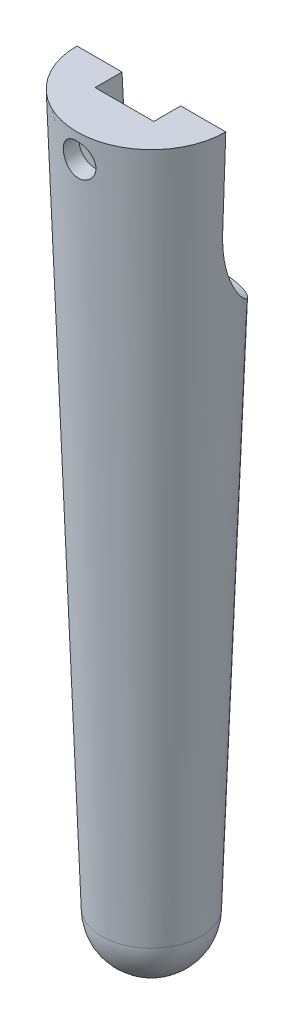
ISO-10303-21;
HEADER;
FILE_DESCRIPTION(('STEP AP214'),'2;1');
FILE_NAME('part.step','',(''),(''),'','','');
FILE_SCHEMA(('AUTOMOTIVE_DESIGN { 1 0 10303 214 1 1 1 1 }'));
ENDSEC;
DATA;
#1=APPLICATION_CONTEXT('core data for automotive mechanical design processes');
#2=APPLICATION_PROTOCOL_DEFINITION('international standard','automotive_design',2000,#1);
#3=PRODUCT_CONTEXT('',#1,'mechanical');
#4=PRODUCT('Part','Part','',(#3));
#5=PRODUCT_RELATED_PRODUCT_CATEGORY('part','',(#4));
#6=PRODUCT_DEFINITION_FORMATION('','',#4);
#7=PRODUCT_DEFINITION_CONTEXT('part definition',#1,'design');
#8=PRODUCT_DEFINITION('design','',#6,#7);
#9=PRODUCT_DEFINITION_SHAPE('','',#8);
#10=(LENGTH_UNIT() NAMED_UNIT(*) SI_UNIT(.MILLI.,.METRE.));
#11=(NAMED_UNIT(*) PLANE_ANGLE_UNIT() SI_UNIT($,.RADIAN.));
#12=(NAMED_UNIT(*) SI_UNIT($,.STERADIAN.) SOLID_ANGLE_UNIT());
#13=UNCERTAINTY_MEASURE_WITH_UNIT(LENGTH_MEASURE(1.E-05),#10,'distance_accuracy_value','');
#14=(GEOMETRIC_REPRESENTATION_CONTEXT(3) GLOBAL_UNCERTAINTY_ASSIGNED_CONTEXT((#13)) GLOBAL_UNIT_ASSIGNED_CONTEXT((#10,
#11,#12)) REPRESENTATION_CONTEXT('',''));
#15=CARTESIAN_POINT('',(0.,0.,0.));
#16=DIRECTION('',(0.,0.,1.));
#17=DIRECTION('',(1.,0.,0.));
#18=AXIS2_PLACEMENT_3D('',#15,#16,#17);
#19=CARTESIAN_POINT('',(1.26287869051112E-11,96.5500000000219,0.));
#20=DIRECTION('',(0.,0.,1.));
#21=DIRECTION('',(1.,0.,0.));
#22=AXIS2_PLACEMENT_3D('',#19,#20,#21);
#23=PLANE('',#22);
#24=DIRECTION('',(0.0348994967025011,0.999390827019096,0.));
#25=VECTOR('',#24,1.);
#26=CARTESIAN_POINT('',(0.,-200.453772980408,0.));
#27=LINE('',#26,#25);
#28=CARTESIAN_POINT('',(10.057110650716,87.5441949078026,0.));
#29=VERTEX_POINT('',#28);
#30=CARTESIAN_POINT('',(10.4920769491748,100.,0.));
#31=VERTEX_POINT('',#30);
#32=EDGE_CURVE('E148',#29,#31,#27,.T.);
#33=ORIENTED_EDGE('',*,*,#32,.F.);
#34=CARTESIAN_POINT('',(1.26287869051112E-11,96.5500000000219,0.));
#35=DIRECTION('',(0.,0.,1.));
#36=DIRECTION('',(1.,0.,0.));
#37=AXIS2_PLACEMENT_3D('',#34,#35,#36);
#38=CIRCLE('',#37,13.4999999999828);
#39=CARTESIAN_POINT('',(2.54703080190939,83.2924499211527,0.));
#40=VERTEX_POINT('',#39);
#41=EDGE_CURVE('E295',#29,#40,#38,.F.);
#42=ORIENTED_EDGE('',*,*,#41,.T.);
#43=DIRECTION('',(0.0545609835210561,0.998510440144326,0.));
#44=VECTOR('',#43,1.);
#45=CARTESIAN_POINT('',(3.14054713278725,94.1542822147181,0.));
#46=LINE('',#45,#44);
#47=CARTESIAN_POINT('',(3.14054713278725,94.1542822147181,0.));
#48=VERTEX_POINT('',#47);
#49=EDGE_CURVE('E245',#40,#48,#46,.T.);
#50=ORIENTED_EDGE('',*,*,#49,.T.);
#51=CARTESIAN_POINT('',(1.26286607405701E-11,96.5500000000219,0.));
#52=DIRECTION('',(0.,0.,1.));
#53=DIRECTION('',(1.,0.,0.));
#54=AXIS2_PLACEMENT_3D('',#51,#52,#53);
#55=CIRCLE('',#54,3.95);
#56=CARTESIAN_POINT('',(3.94997479220084,96.5358882645625,0.));
#57=VERTEX_POINT('',#56);
#58=EDGE_CURVE('E133',#48,#57,#55,.T.);
#59=ORIENTED_EDGE('',*,*,#58,.T.);
#60=DIRECTION('',(-0.0545609835210561,-0.998510440144326,0.));
#61=VECTOR('',#60,1.);
#62=CARTESIAN_POINT('',(3.94997479220084,96.5358882645625,0.));
#63=LINE('',#62,#61);
#64=CARTESIAN_POINT('',(4.13926209027355,100.,0.));
#65=VERTEX_POINT('',#64);
#66=EDGE_CURVE('E127',#65,#57,#63,.T.);
#67=ORIENTED_EDGE('',*,*,#66,.F.);
#68=DIRECTION('',(1.,0.,0.));
#69=VECTOR('',#68,1.);
#70=CARTESIAN_POINT('',(0.,100.,0.));
#71=LINE('',#70,#69);
#72=EDGE_CURVE('E130',#65,#31,#71,.T.);
#73=ORIENTED_EDGE('',*,*,#72,.T.);
#74=EDGE_LOOP('',(#33,#42,#50,#59,#67,#73));
#75=FACE_BOUND('',#74,.T.);
#76=ADVANCED_FACE('F39',(#75),#23,.F.);
#77=CARTESIAN_POINT('',(0.,0.,0.));
#78=DIRECTION('',(0.,1.,0.));
#79=DIRECTION('',(0.,0.,1.));
#80=AXIS2_PLACEMENT_3D('',#77,#78,#79);
#81=CONICAL_SURFACE('',#80,7.,0.0349065850398867);
#82=CARTESIAN_POINT('',(-1.64992104987884,94.9475766698289,10.1828404412526));
#83=CARTESIAN_POINT('',(-1.73919596378949,95.0395027192175,10.1716275625867));
#84=CARTESIAN_POINT('',(-1.82082745845652,95.138958223404,10.160726093328));
#85=CARTESIAN_POINT('',(-1.96650143168217,95.3502679657733,10.141059490115));
#86=CARTESIAN_POINT('',(-2.03053379267208,95.4621292842945,10.13229558535));
#87=CARTESIAN_POINT('',(-2.13913797435218,95.6952340145005,10.1182461436707));
#88=CARTESIAN_POINT('',(-2.18369844168915,95.8164828513397,10.1129626351403));
#89=CARTESIAN_POINT('',(-2.25192475390324,96.0648101008327,10.1068752154501));
#90=CARTESIAN_POINT('',(-2.27559570905781,96.1918870797204,10.1060702084423));
#91=CARTESIAN_POINT('',(-2.30116220108725,96.4462790908929,10.1093902617387));
#92=CARTESIAN_POINT('',(-2.3033689514045,96.5735638703085,10.1134439013857));
#93=CARTESIAN_POINT('',(-2.28683245595834,96.8265211840433,10.1262516477096));
#94=CARTESIAN_POINT('',(-2.26808877985903,96.9521936851915,10.1350058509372));
#95=CARTESIAN_POINT('',(-2.21039811256436,97.1981182822743,10.1565317203145));
#96=CARTESIAN_POINT('',(-2.17149936934436,97.3183825806752,10.1692937637305));
#97=CARTESIAN_POINT('',(-2.07473717396291,97.5506497027634,10.1977513038028));
#98=CARTESIAN_POINT('',(-2.01687112534424,97.6626513927993,10.2134472019513));
#99=CARTESIAN_POINT('',(-1.8822426195446,97.8780289216952,10.2467691387484));
#100=CARTESIAN_POINT('',(-1.80507411404669,97.9811453814807,10.264431419282));
#101=CARTESIAN_POINT('',(-1.63463424979343,98.1730986121634,10.2997352086698));
#102=CARTESIAN_POINT('',(-1.54136092601835,98.2619336379627,10.3173767147244));
#103=CARTESIAN_POINT('',(-1.33948364277009,98.424253584942,10.3512524804897));
#104=CARTESIAN_POINT('',(-1.23065510707794,98.4974654852832,10.3674592005593));
#105=CARTESIAN_POINT('',(-1.00179942525342,98.6244925904066,10.3965241189878));
#106=CARTESIAN_POINT('',(-0.881773501302927,98.6783099089738,10.4093826822147));
#107=CARTESIAN_POINT('',(-0.635887211832571,98.7641214696164,10.4302698351862));
#108=CARTESIAN_POINT('',(-0.51014852707311,98.7964461051787,10.438371313901));
#109=CARTESIAN_POINT('',(-0.254809118315023,98.8395036083754,10.4492254624981));
#110=CARTESIAN_POINT('',(-0.125209125124158,98.8502405357772,10.4519791380806));
#111=CARTESIAN_POINT('',(0.130453633407846,98.849757762061,10.451856549519));
#112=CARTESIAN_POINT('',(0.256517987254769,98.8391195715972,10.449129391165));
#113=CARTESIAN_POINT('',(0.504993891668115,98.7974099013381,10.4386135524253));
#114=CARTESIAN_POINT('',(0.627405478337431,98.7663386235675,10.430824922083));
#115=CARTESIAN_POINT('',(0.865039730109908,98.6848229817193,10.4109541419713));
#116=CARTESIAN_POINT('',(0.980271083593251,98.6344025816638,10.3988773045532));
#117=CARTESIAN_POINT('',(1.20071856444346,98.5156942267308,10.371562827916));
#118=CARTESIAN_POINT('',(1.30593323725316,98.4474036822483,10.3563247306576));
#119=CARTESIAN_POINT('',(1.50627687581789,98.2928551787577,10.3236605160806));
#120=CARTESIAN_POINT('',(1.60107638052199,98.2061798488678,10.3061881619442));
#121=CARTESIAN_POINT('',(1.7749538265541,98.0183073158587,10.2710141728444));
#122=CARTESIAN_POINT('',(1.85402958819198,97.9171081027221,10.2533125064544));
#123=CARTESIAN_POINT('',(1.99568556862242,97.7007677689217,10.2189989764335));
#124=CARTESIAN_POINT('',(2.05792584619123,97.5853993325405,10.2024140268606));
#125=CARTESIAN_POINT('',(2.16203224305112,97.3454348288393,10.1722960145521));
#126=CARTESIAN_POINT('',(2.20390035691554,97.2208396662554,10.1587626531149));
#127=CARTESIAN_POINT('',(2.26546979369175,96.9676149260736,10.1361487843385));
#128=CARTESIAN_POINT('',(2.28545167013979,96.8390586665286,10.1270127819125));
#129=CARTESIAN_POINT('',(2.30345803855993,96.5801711689549,10.1136611887188));
#130=CARTESIAN_POINT('',(2.301486159406,96.4498402278316,10.1094447848872));
#131=CARTESIAN_POINT('',(2.27588739332845,96.1944613434707,10.1060959851112));
#132=CARTESIAN_POINT('',(2.25278632937358,96.069361907877,10.1068428870513));
#133=CARTESIAN_POINT('',(2.18634457443719,95.8247704297894,10.1126841994544));
#134=CARTESIAN_POINT('',(2.14300363585547,95.7052784559128,10.1177786631031));
#135=CARTESIAN_POINT('',(2.0373649751987,95.4752116389152,10.1313822317331));
#136=CARTESIAN_POINT('',(1.97506664119963,95.3646370837845,10.1398914469418));
#137=CARTESIAN_POINT('',(1.83327222730296,95.1553328652881,10.1590557673891));
#138=CARTESIAN_POINT('',(1.75377407729557,95.0566046299297,10.16971113092));
#139=CARTESIAN_POINT('',(1.57798896949655,94.8717457738773,10.1919466758002));
#140=CARTESIAN_POINT('',(1.48140130316517,94.785902634086,10.203540971169));
#141=CARTESIAN_POINT('',(1.27517100439738,94.6315290891314,10.2259265732837));
#142=CARTESIAN_POINT('',(1.16552780674567,94.5629994339249,10.2367178452312));
#143=CARTESIAN_POINT('',(0.935357557569262,94.444778499597,10.256171639512));
#144=CARTESIAN_POINT('',(0.814760246887608,94.3952212721704,10.2648188671107));
#145=CARTESIAN_POINT('',(0.566759395946518,94.3171365959649,10.2787619001937));
#146=CARTESIAN_POINT('',(0.439356697997057,94.2886065510678,10.2840581193984));
#147=CARTESIAN_POINT('',(0.183268524341992,94.253725062482,10.2905665377222));
#148=CARTESIAN_POINT('',(0.0546259919532527,94.2470686507621,10.2918348860173));
#149=CARTESIAN_POINT('',(-0.201956062062696,94.2552913187593,10.2902852759112));
#150=CARTESIAN_POINT('',(-0.329895534379168,94.2701718901498,10.2874670344686));
#151=CARTESIAN_POINT('',(-0.580240427212458,94.3207646026803,10.2781443213567));
#152=CARTESIAN_POINT('',(-0.702684986002133,94.3562900391249,10.271672902514));
#153=CARTESIAN_POINT('',(-0.93982847471391,94.4469496064954,10.2558734227231));
#154=CARTESIAN_POINT('',(-1.05453147016883,94.5020733483922,10.2465468756368));
#155=CARTESIAN_POINT('',(-1.25297742114045,94.6184867090068,10.2280793182706));
#156=CARTESIAN_POINT('',(-1.33853017081327,94.6767674022808,10.2192209274875));
#157=CARTESIAN_POINT('',(-1.50101820774092,94.8042596763618,10.2011210564788));
#158=CARTESIAN_POINT('',(-1.57795319597716,94.8734716362606,10.1918795629756));
#159=CARTESIAN_POINT('',(-1.64992104987884,94.9475766698289,10.1828404412526));
#160=B_SPLINE_CURVE_WITH_KNOTS('',3,(#82,#83,#84,#85,#86,#87,#88,#89,#90,#91,#92,#93,#94,#95,
#96,#97,#98,#99,#100,#101,#102,#103,#104,#105,#106,#107,#108,#109,#110,#111,#112,#113,#114,#115,
#116,#117,#118,#119,#120,#121,#122,#123,#124,#125,#126,#127,#128,#129,#130,#131,#132,#133,#134,
#135,#136,#137,#138,#139,#140,#141,#142,#143,#144,#145,#146,#147,#148,#149,#150,#151,#152,#153,
#154,#155,#156,#157,#158,#159),.UNSPECIFIED.,.T.,.F.,(4,2,2,2,2,2,2,2,2,2,2,2,2,2,2,2,2,2,2,2,2,
2,2,2,2,2,2,2,2,2,2,2,2,2,2,2,2,2,4),(0.,0.385530507759354,0.771282191812696,1.15725849450898,
1.54314034822105,1.92341874130666,2.30370494571061,2.68308498363545,3.06251697705385,
3.45072365445819,3.83897773218296,4.23354357075872,4.62806639320838,5.01637489139934,
5.40461035776657,5.78242686488873,6.16023963654426,6.53758598678084,6.9149870494833,
7.30210595076344,7.68927847870802,8.08376715283829,8.47821719606943,8.86754947552642,
9.25681740076419,9.63665400033275,10.0164952466737,10.3963487551762,10.7762480069784,
11.1636541335475,11.5510770382569,11.9411889071399,12.3312526028431,12.7158543211952,
13.1004826787273,13.4816855642676,13.8626866753496,14.173466486282,14.4842570772966),.UNSPECIFIED.);
#161=CARTESIAN_POINT('',(-1.64992104987884,94.9475766698289,10.1828404412526));
#162=VERTEX_POINT('',#161);
#163=EDGE_CURVE('E167',#162,#162,#160,.T.);
#164=ORIENTED_EDGE('',*,*,#163,.T.);
#165=EDGE_LOOP('',(#164));
#166=FACE_BOUND('',#165,.T.);
#167=CARTESIAN_POINT('',(0.,0.,0.));
#168=DIRECTION('',(0.,-1.,0.));
#169=DIRECTION('',(0.,0.,1.));
#170=AXIS2_PLACEMENT_3D('',#167,#168,#169);
#171=CIRCLE('',#170,7.);
#172=CARTESIAN_POINT('',(0.,0.,7.));
#173=VERTEX_POINT('',#172);
#174=EDGE_CURVE('E277',#173,#173,#171,.T.);
#175=ORIENTED_EDGE('',*,*,#174,.F.);
#176=EDGE_LOOP('',(#175));
#177=FACE_BOUND('',#176,.T.);
#178=DIRECTION('',(0.0348994967025011,-0.999390827019096,0.));
#179=VECTOR('',#178,1.);
#180=CARTESIAN_POINT('',(0.,-200.453772980408,0.));
#181=LINE('',#180,#179);
#182=CARTESIAN_POINT('',(-10.4920769491748,100.,0.));
#183=VERTEX_POINT('',#182);
#184=CARTESIAN_POINT('',(-10.0571106507171,87.544194907832,0.));
#185=VERTEX_POINT('',#184);
#186=EDGE_CURVE('E253',#183,#185,#181,.T.);
#187=ORIENTED_EDGE('',*,*,#186,.T.);
#188=CARTESIAN_POINT('',(-10.0571106507171,87.544194907832,0.));
#189=CARTESIAN_POINT('',(-10.0479617856498,87.2827104145667,2.14360202404483E-05));
#190=CARTESIAN_POINT('',(-10.0388446627048,87.0211751517433,-0.0042145009018167));
#191=CARTESIAN_POINT('',(-10.0205720071195,86.4983213888195,-0.0224134494180009));
#192=CARTESIAN_POINT('',(-10.0114164575847,86.2370030619779,-0.0363813131896706));
#193=CARTESIAN_POINT('',(-9.99294020418656,85.7142073105471,-0.0753301014465357));
#194=CARTESIAN_POINT('',(-9.98361901811822,85.4527328110487,-0.100351189358853));
#195=CARTESIAN_POINT('',(-9.96459010641846,84.9312609090704,-0.162452002840951));
#196=CARTESIAN_POINT('',(-9.95488244129054,84.6712632826108,-0.199529847382317));
#197=CARTESIAN_POINT('',(-9.93465121151914,84.1530679471528,-0.286678605538028));
#198=CARTESIAN_POINT('',(-9.92412644266742,83.8948735302454,-0.336768961371699));
#199=CARTESIAN_POINT('',(-9.90166827634558,83.3815682809044,-0.450564111292405));
#200=CARTESIAN_POINT('',(-9.88973496861837,83.1264572531578,-0.51426803822075));
#201=CARTESIAN_POINT('',(-9.8636712060295,82.6206588837594,-0.655584445849802));
#202=CARTESIAN_POINT('',(-9.84954431900583,82.3699650820538,-0.733174371816361));
#203=CARTESIAN_POINT('',(-9.81807444882089,81.8736283043539,-0.902439327140019));
#204=CARTESIAN_POINT('',(-9.80073196035225,81.6279845579006,-0.994112189587032));
#205=CARTESIAN_POINT('',(-9.75596160860868,81.0722183302353,-1.2200732846152));
#206=CARTESIAN_POINT('',(-9.72706748257865,80.7640835775062,-1.35900650062587));
#207=CARTESIAN_POINT('',(-9.65899805399721,80.1599510950382,-1.6590754632064));
#208=CARTESIAN_POINT('',(-9.61982167772489,79.8639546365715,-1.82021352767575));
#209=CARTESIAN_POINT('',(-9.52807431793416,79.2869636430863,-2.1623276415011));
#210=CARTESIAN_POINT('',(-9.47554218709323,79.0059284052246,-2.343245295221));
#211=CARTESIAN_POINT('',(-9.3537075747175,78.4598006917572,-2.72267096548586));
#212=CARTESIAN_POINT('',(-9.28440572970214,78.1947076115199,-2.92117831420657));
#213=CARTESIAN_POINT('',(-9.12515692360887,77.6800314173945,-3.33410679972345));
#214=CARTESIAN_POINT('',(-9.03504806280337,77.4305905374542,-3.54864330732498));
#215=CARTESIAN_POINT('',(-8.8314963037939,76.9510348222802,-3.98808855086921));
#216=CARTESIAN_POINT('',(-8.71805242667813,76.7209207983852,-4.21299772164146));
#217=CARTESIAN_POINT('',(-8.46537250819309,76.2812524246772,-4.6684302245241));
#218=CARTESIAN_POINT('',(-8.32613586435693,76.0716985552827,-4.89895368766376));
#219=CARTESIAN_POINT('',(-8.02017174955543,75.674113838139,-5.36032196740838));
#220=CARTESIAN_POINT('',(-7.85344950404131,75.4860789107855,-5.59116671467634));
#221=CARTESIAN_POINT('',(-7.51473799766058,75.1545775233758,-6.01859442664462));
#222=CARTESIAN_POINT('',(-7.34610619285782,75.0084836486078,-6.21580560792948));
#223=CARTESIAN_POINT('',(-6.98743503630847,74.7332352024146,-6.60245209866563));
#224=CARTESIAN_POINT('',(-6.79739719888507,74.6040794341372,-6.79188795687326));
#225=CARTESIAN_POINT('',(-6.39674571252604,74.3626560560178,-7.15919319861802));
#226=CARTESIAN_POINT('',(-6.18614239210329,74.2503800399562,-7.3370683142519));
#227=CARTESIAN_POINT('',(-5.74559594141981,74.0422974549951,-7.67786652109068));
#228=CARTESIAN_POINT('',(-5.51565495029745,73.9464890680017,-7.84079126195151));
#229=CARTESIAN_POINT('',(-5.06825286174055,73.7818268565324,-8.12921981283683));
#230=CARTESIAN_POINT('',(-4.8528478501432,73.711099196556,-8.25685379169989));
#231=CARTESIAN_POINT('',(-4.41012837015727,73.5813586200401,-8.49645601526702));
#232=CARTESIAN_POINT('',(-4.18281463557907,73.5223449827581,-8.60842522367057));
#233=CARTESIAN_POINT('',(-3.71805433933199,73.4155634250683,-8.81507908546756));
#234=CARTESIAN_POINT('',(-3.48061242834264,73.3677904074551,-8.90977156882521));
#235=CARTESIAN_POINT('',(-2.99730989987136,73.2829640179754,-9.08064739898107));
#236=CARTESIAN_POINT('',(-2.75144983443193,73.2459099446861,-9.15683195684264));
#237=CARTESIAN_POINT('',(-2.28368375491903,73.1859762706578,-9.28157467449171));
#238=CARTESIAN_POINT('',(-2.0625213163052,73.1619179609683,-9.33237097161193));
#239=CARTESIAN_POINT('',(-1.61642889069363,73.1214583778837,-9.41845639247972));
#240=CARTESIAN_POINT('',(-1.39149773857562,73.1050595194499,-9.45374062519656));
#241=CARTESIAN_POINT('',(-0.939300402687875,73.0797483144126,-9.50843351810301));
#242=CARTESIAN_POINT('',(-0.712034252310052,73.0708358608992,-9.5278424050008));
#243=CARTESIAN_POINT('',(-0.25661262951372,73.0603944449669,-9.55059845524413));
#244=CARTESIAN_POINT('',(-0.0284574880701886,73.0588629567073,-9.55395111319033));
#245=CARTESIAN_POINT('',(0.447797061515262,73.0633497686636,-9.54415657215643));
#246=CARTESIAN_POINT('',(0.695860846520801,73.0700534328997,-9.52951148401246));
#247=CARTESIAN_POINT('',(1.18975302188162,73.0922834982841,-9.48130506649337));
#248=CARTESIAN_POINT('',(1.4355812915585,73.1078103728913,-9.4477427220075));
#249=CARTESIAN_POINT('',(1.92329100392881,73.1479004491957,-9.36207540962399));
#250=CARTESIAN_POINT('',(2.16517163726655,73.172465480208,-9.30996668802571));
#251=CARTESIAN_POINT('',(2.64320298094326,73.2309385457203,-9.1878152362142));
#252=CARTESIAN_POINT('',(2.87935378259335,73.2648464312253,-9.11777279200022));
#253=CARTESIAN_POINT('',(3.34421861805832,73.3423811672825,-8.96060305500538));
#254=CARTESIAN_POINT('',(3.57293374394649,73.3860065831696,-8.87347828443178));
#255=CARTESIAN_POINT('',(4.02136302273483,73.4834037793925,-8.68321193748473));
#256=CARTESIAN_POINT('',(4.24107718313181,73.5371755512773,-8.58007037445182));
#257=CARTESIAN_POINT('',(4.66997243737138,73.6552877877384,-8.35910406154989));
#258=CARTESIAN_POINT('',(4.87915555080543,73.7196262157292,-8.24128214218252));
#259=CARTESIAN_POINT('',(5.28569198003548,73.8592866304948,-7.99248167500682));
#260=CARTESIAN_POINT('',(5.4830452959759,73.9346086171354,-7.86150312735912));
#261=CARTESIAN_POINT('',(5.86538661369396,74.0968474538151,-7.58770171460822));
#262=CARTESIAN_POINT('',(6.0503326578612,74.1838009357825,-7.44484199216639));
#263=CARTESIAN_POINT('',(6.40622729038958,74.3693806213015,-7.14960141582521));
#264=CARTESIAN_POINT('',(6.57717592925981,74.4680067827296,-6.99722059628585));
#265=CARTESIAN_POINT('',(6.90441505709306,74.6770937569714,-6.68503145226276));
#266=CARTESIAN_POINT('',(7.06070543118996,74.7875546625108,-6.5252230695893));
#267=CARTESIAN_POINT('',(7.35825708679709,75.0203544067507,-6.20036347182684));
#268=CARTESIAN_POINT('',(7.49951798463665,75.142693548525,-6.03531212303562));
#269=CARTESIAN_POINT('',(7.77230115122743,75.4043187143365,-5.69550369928737));
#270=CARTESIAN_POINT('',(7.90320577221209,75.5440875789489,-5.52062282554528));
#271=CARTESIAN_POINT('',(8.14893387967135,75.8361727820563,-5.17006310805664));
#272=CARTESIAN_POINT('',(8.26375702157296,75.9884893892971,-4.99438424729512));
#273=CARTESIAN_POINT('',(8.47794637799129,76.3053878140952,-4.64454553440879));
#274=CARTESIAN_POINT('',(8.57730658848282,76.4699743593814,-4.4703862969836));
#275=CARTESIAN_POINT('',(8.76138840726206,76.8109090914127,-4.12589933601279));
#276=CARTESIAN_POINT('',(8.84610934858683,76.9872578135336,-3.95557178734569));
#277=CARTESIAN_POINT('',(9.01021272368522,77.3703069286809,-3.60321702709383));
#278=CARTESIAN_POINT('',(9.08809794225478,77.5782492426758,-3.42184194324775));
#279=CARTESIAN_POINT('',(9.22908398581185,78.0069753370046,-3.06879663604285));
#280=CARTESIAN_POINT('',(9.29218389480513,78.2277599118979,-2.89712701446613));
#281=CARTESIAN_POINT('',(9.40550967579284,78.6811254629709,-2.56569844862165));
#282=CARTESIAN_POINT('',(9.45573953766191,78.9137027564119,-2.4059358239548));
#283=CARTESIAN_POINT('',(9.54536240505633,79.389643772249,-2.10004081094701));
#284=CARTESIAN_POINT('',(9.58475504775326,79.6330078554685,-1.95390887906778));
#285=CARTESIAN_POINT('',(9.65969556060739,80.1647300353033,-1.6569248905733));
#286=CARTESIAN_POINT('',(9.69389698786331,80.4545601543862,-1.50836429056833));
#287=CARTESIAN_POINT('',(9.75362375736374,81.0449499654201,-1.23230148284336));
#288=CARTESIAN_POINT('',(9.77914812733654,81.3455108555965,-1.10480163582114));
#289=CARTESIAN_POINT('',(9.82411670195538,81.9560899335618,-0.871342797696462));
#290=CARTESIAN_POINT('',(9.84354701730215,82.2661279829081,-0.765433203538036));
#291=CARTESIAN_POINT('',(9.87839916903016,82.8930066871145,-0.575560881766749));
#292=CARTESIAN_POINT('',(9.89382141834499,83.2098466375602,-0.491595893291685));
#293=CARTESIAN_POINT('',(9.92278053730949,83.8584805290252,-0.342657715564415));
#294=CARTESIAN_POINT('',(9.93624332975298,84.190432200614,-0.278360853319928));
#295=CARTESIAN_POINT('',(9.96198001818223,84.8578677193654,-0.171002799303154));
#296=CARTESIAN_POINT('',(9.97425349937718,85.1933527539388,-0.127948995109555));
#297=CARTESIAN_POINT('',(9.99832401961588,85.8645657806488,-0.0613039741196875));
#298=CARTESIAN_POINT('',(10.0101231062478,86.2002844506737,-0.037618012012749));
#299=CARTESIAN_POINT('',(10.02776925411,86.7042138075004,-0.0146294706176147));
#300=CARTESIAN_POINT('',(10.0336398832244,86.8721719166428,-0.00905637683525256));
#301=CARTESIAN_POINT('',(10.0453760564093,87.2081513720278,-0.001740930878733));
#302=CARTESIAN_POINT('',(10.0512416010368,87.3761727073568,1.91396651934407E-06));
#303=CARTESIAN_POINT('',(10.0571106507168,87.5441949078026,0.));
#304=B_SPLINE_CURVE_WITH_KNOTS('',3,(#188,#189,#190,#191,#192,#193,#194,#195,#196,#197,#198,
#199,#200,#201,#202,#203,#204,#205,#206,#207,#208,#209,#210,#211,#212,#213,#214,#215,#216,#217,
#218,#219,#220,#221,#222,#223,#224,#225,#226,#227,#228,#229,#230,#231,#232,#233,#234,#235,#236,
#237,#238,#239,#240,#241,#242,#243,#244,#245,#246,#247,#248,#249,#250,#251,#252,#253,#254,#255,
#256,#257,#258,#259,#260,#261,#262,#263,#264,#265,#266,#267,#268,#269,#270,#271,#272,#273,#274,
#275,#276,#277,#278,#279,#280,#281,#282,#283,#284,#285,#286,#287,#288,#289,#290,#291,#292,#293,
#294,#295,#296,#297,#298,#299,#300,#301,#302,#303),.UNSPECIFIED.,.F.,.F.,(4,2,2,2,2,2,2,2,2,2,2,
2,2,2,2,2,2,2,2,2,2,2,2,2,2,2,2,2,2,2,2,2,2,2,2,2,2,2,2,2,2,2,2,2,2,2,2,2,2,2,2,2,2,2,2,2,2,4),
(0.,0.784972738395995,1.57033713152644,2.3585790342751,3.14669801884185,3.93600138690671,
4.7252544928205,5.51323707818946,6.30109853964748,7.3177215661141,8.33445079540247,
9.34825548259989,10.3620216953667,11.3839589774718,12.4059391389372,13.4279431748038,
14.449753134998,15.3418043466421,16.233792491651,17.1253349390746,18.0167788932298,
18.7963331448343,19.5758394170124,20.3549915277335,21.1340926410113,21.8180011507952,
22.5021251459321,23.1862393712531,23.87011946917,24.614978714319,25.3598779328446,
26.1049280013278,26.8499661888149,27.5948944540642,28.339822098859,29.0846063366753,
29.8293905653984,30.5765781908273,31.3237631199404,32.0709539037066,32.8181637570947,
33.5953360093004,34.3725249111935,35.1500148350254,35.9275401718482,36.7867938240316,
37.6461006954867,38.5051408479236,39.3642097573924,40.345618789747,41.3271377536069,
42.310877763475,43.2945163826796,44.3089276384421,45.3236914220869,46.3334608858727,
46.8378843966005,47.3422430213545),.UNSPECIFIED.);
#305=EDGE_CURVE('E220',#185,#29,#304,.T.);
#306=ORIENTED_EDGE('',*,*,#305,.T.);
#307=ORIENTED_EDGE('',*,*,#32,.T.);
#308=CARTESIAN_POINT('',(0.,100.,0.));
#309=DIRECTION('',(0.,1.,0.));
#310=DIRECTION('',(0.,0.,1.));
#311=AXIS2_PLACEMENT_3D('',#308,#309,#310);
#312=CIRCLE('',#311,10.4920769491748);
#313=EDGE_CURVE('E147',#183,#31,#312,.T.);
#314=ORIENTED_EDGE('',*,*,#313,.F.);
#315=EDGE_LOOP('',(#187,#306,#307,#314));
#316=FACE_BOUND('',#315,.T.);
#317=ADVANCED_FACE('F175',(#166,#177,#316),#81,.T.);
#318=CARTESIAN_POINT('',(0.,100.,0.));
#319=DIRECTION('',(0.,1.,0.));
#320=DIRECTION('',(0.,0.,1.));
#321=AXIS2_PLACEMENT_3D('',#318,#319,#320);
#322=PLANE('',#321);
#323=CARTESIAN_POINT('',(-4.13926209027355,100.,0.));
#324=VERTEX_POINT('',#323);
#325=EDGE_CURVE('E150',#183,#324,#71,.T.);
#326=ORIENTED_EDGE('',*,*,#325,.F.);
#327=ORIENTED_EDGE('',*,*,#313,.T.);
#328=ORIENTED_EDGE('',*,*,#72,.F.);
#329=DIRECTION('',(0.,0.,-1.));
#330=VECTOR('',#329,1.);
#331=CARTESIAN_POINT('',(4.13926209027355,100.,0.));
#332=LINE('',#331,#330);
#333=CARTESIAN_POINT('',(4.13926209027355,100.,3.8));
#334=VERTEX_POINT('',#333);
#335=EDGE_CURVE('E145',#334,#65,#332,.T.);
#336=ORIENTED_EDGE('',*,*,#335,.F.);
#337=DIRECTION('',(1.,0.,0.));
#338=VECTOR('',#337,1.);
#339=CARTESIAN_POINT('',(0.,100.,3.8));
#340=LINE('',#339,#338);
#341=CARTESIAN_POINT('',(-4.13926209027355,100.,3.8));
#342=VERTEX_POINT('',#341);
#343=EDGE_CURVE('E155',#342,#334,#340,.T.);
#344=ORIENTED_EDGE('',*,*,#343,.F.);
#345=DIRECTION('',(0.,0.,-1.));
#346=VECTOR('',#345,1.);
#347=CARTESIAN_POINT('',(-4.13926209027355,100.,0.));
#348=LINE('',#347,#346);
#349=EDGE_CURVE('E138',#342,#324,#348,.T.);
#350=ORIENTED_EDGE('',*,*,#349,.T.);
#351=EDGE_LOOP('',(#326,#327,#328,#336,#344,#350));
#352=FACE_BOUND('',#351,.T.);
#353=ADVANCED_FACE('F143',(#352),#322,.T.);
#354=CARTESIAN_POINT('',(0.,0.,0.));
#355=DIRECTION('',(0.,0.,-1.));
#356=DIRECTION('',(-1.,0.,0.));
#357=AXIS2_PLACEMENT_3D('',#354,#355,#356);
#358=SPHERICAL_SURFACE('',#357,7.);
#359=CARTESIAN_POINT('',(0.,0.,0.));
#360=DIRECTION('',(0.,-1.,0.));
#361=DIRECTION('',(0.,0.,1.));
#362=AXIS2_PLACEMENT_3D('',#359,#360,#361);
#363=SPHERICAL_SURFACE('',#362,7.);
#364=ORIENTED_EDGE('',*,*,#174,.T.);
#365=EDGE_LOOP('',(#364));
#366=FACE_BOUND('',#365,.T.);
#367=ADVANCED_FACE('F288',(#366),#363,.T.);
#368=CARTESIAN_POINT('',(1.26286607405701E-11,96.5500000000219,-10.4920769491748));
#369=DIRECTION('',(0.,0.,1.));
#370=DIRECTION('',(1.,0.,0.));
#371=AXIS2_PLACEMENT_3D('',#368,#369,#370);
#372=CYLINDRICAL_SURFACE('',#371,3.95);
#373=DIRECTION('',(0.,0.,1.));
#374=VECTOR('',#373,1.);
#375=CARTESIAN_POINT('',(-3.1405471327892,94.1542822147537,-10.4920769491748));
#376=LINE('',#375,#374);
#377=CARTESIAN_POINT('',(-3.1405471327892,94.1542822147537,0.));
#378=VERTEX_POINT('',#377);
#379=CARTESIAN_POINT('',(-3.1405471327892,94.1542822147537,3.8));
#380=VERTEX_POINT('',#379);
#381=EDGE_CURVE('E274',#378,#380,#376,.T.);
#382=ORIENTED_EDGE('',*,*,#381,.F.);
#383=CARTESIAN_POINT('',(1.26286607405701E-11,96.5500000000219,0.));
#384=DIRECTION('',(0.,0.,1.));
#385=DIRECTION('',(1.,0.,0.));
#386=AXIS2_PLACEMENT_3D('',#383,#384,#385);
#387=CIRCLE('',#386,3.95);
#388=CARTESIAN_POINT('',(-3.94997479217382,96.5358882640678,0.));
#389=VERTEX_POINT('',#388);
#390=EDGE_CURVE('E243',#378,#389,#387,.F.);
#391=ORIENTED_EDGE('',*,*,#390,.T.);
#392=DIRECTION('',(0.,0.,1.));
#393=VECTOR('',#392,1.);
#394=CARTESIAN_POINT('',(-3.94997479217382,96.5358882640678,-10.4920769491748));
#395=LINE('',#394,#393);
#396=CARTESIAN_POINT('',(-3.94997479217382,96.5358882640678,3.8));
#397=VERTEX_POINT('',#396);
#398=EDGE_CURVE('E275',#389,#397,#395,.T.);
#399=ORIENTED_EDGE('',*,*,#398,.T.);
#400=CARTESIAN_POINT('',(1.26286607405701E-11,96.5500000000219,3.8));
#401=DIRECTION('',(0.,0.,1.));
#402=DIRECTION('',(1.,0.,0.));
#403=AXIS2_PLACEMENT_3D('',#400,#401,#402);
#404=CIRCLE('',#403,3.95);
#405=EDGE_CURVE('E165',#397,#380,#404,.T.);
#406=ORIENTED_EDGE('',*,*,#405,.T.);
#407=EDGE_LOOP('',(#382,#391,#399,#406));
#408=FACE_BOUND('',#407,.T.);
#409=ADVANCED_FACE('F205',(#408),#372,.F.);
#410=CARTESIAN_POINT('',(1.26286607405701E-11,96.5500000000219,-10.4920769491748));
#411=DIRECTION('',(0.,0.,1.));
#412=DIRECTION('',(1.,0.,0.));
#413=AXIS2_PLACEMENT_3D('',#410,#411,#412);
#414=CYLINDRICAL_SURFACE('',#413,3.95);
#415=ORIENTED_EDGE('',*,*,#58,.F.);
#416=DIRECTION('',(0.,0.,1.));
#417=VECTOR('',#416,1.);
#418=CARTESIAN_POINT('',(3.14054713278725,94.1542822147181,-10.4920769491748));
#419=LINE('',#418,#417);
#420=CARTESIAN_POINT('',(3.14054713278725,94.1542822147181,3.8));
#421=VERTEX_POINT('',#420);
#422=EDGE_CURVE('E280',#48,#421,#419,.T.);
#423=ORIENTED_EDGE('',*,*,#422,.T.);
#424=CARTESIAN_POINT('',(1.26286607405701E-11,96.5500000000219,3.8));
#425=DIRECTION('',(0.,0.,-1.));
#426=DIRECTION('',(-1.,0.,0.));
#427=AXIS2_PLACEMENT_3D('',#424,#425,#426);
#428=CIRCLE('',#427,3.95);
#429=CARTESIAN_POINT('',(3.94997479220084,96.5358882645625,3.8));
#430=VERTEX_POINT('',#429);
#431=EDGE_CURVE('E268',#430,#421,#428,.T.);
#432=ORIENTED_EDGE('',*,*,#431,.F.);
#433=DIRECTION('',(0.,0.,1.));
#434=VECTOR('',#433,1.);
#435=CARTESIAN_POINT('',(3.94997479220084,96.5358882645625,-10.4920769491748));
#436=LINE('',#435,#434);
#437=EDGE_CURVE('E278',#57,#430,#436,.T.);
#438=ORIENTED_EDGE('',*,*,#437,.F.);
#439=EDGE_LOOP('',(#415,#423,#432,#438));
#440=FACE_BOUND('',#439,.T.);
#441=ADVANCED_FACE('F201',(#440),#414,.F.);
#442=CARTESIAN_POINT('',(3.14054713278725,94.1542822147181,-10.4920769491748));
#443=DIRECTION('',(-0.998510440144326,0.0545609835210561,0.));
#444=DIRECTION('',(-0.0545609835210561,-0.998510440144326,0.));
#445=AXIS2_PLACEMENT_3D('',#442,#443,#444);
#446=PLANE('',#445);
#447=ORIENTED_EDGE('',*,*,#49,.F.);
#448=CARTESIAN_POINT('',(2.54703080190939,83.2924499211527,0.));
#449=CARTESIAN_POINT('',(2.53855525432922,83.1373404968243,1.008539009557E-05));
#450=CARTESIAN_POINT('',(2.53008792580085,82.9823814878386,-0.00339959477169486));
#451=CARTESIAN_POINT('',(2.5131696919182,82.6727640273302,-0.0170584982523672));
#452=CARTESIAN_POINT('',(2.50471878659293,82.5181055763386,-0.027307733642379));
#453=CARTESIAN_POINT('',(2.49627610034849,82.3635975412205,-0.0409767466554066));
#454=B_SPLINE_CURVE_WITH_KNOTS('',3,(#448,#449,#450,#451,#452,#453),.UNSPECIFIED.,.F.,.F.,(4,2,
4),(0.,0.465682879579463,0.931366581044736),.UNSPECIFIED.);
#455=CARTESIAN_POINT('',(2.49627610034849,82.3635975412205,-0.0409767466554075));
#456=VERTEX_POINT('',#455);
#457=EDGE_CURVE('E214',#40,#456,#454,.T.);
#458=ORIENTED_EDGE('',*,*,#457,.T.);
#459=DIRECTION('',(0.,0.,1.));
#460=VECTOR('',#459,1.);
#461=CARTESIAN_POINT('',(2.49627610034849,82.3635975412205,-10.4920769491748));
#462=LINE('',#461,#460);
#463=CARTESIAN_POINT('',(2.49627610034849,82.3635975412205,3.8));
#464=VERTEX_POINT('',#463);
#465=EDGE_CURVE('E66',#456,#464,#462,.T.);
#466=ORIENTED_EDGE('',*,*,#465,.T.);
#467=DIRECTION('',(-0.0545609835210561,-0.998510440144326,0.));
#468=VECTOR('',#467,1.);
#469=CARTESIAN_POINT('',(3.14054713278725,94.1542822147181,3.8));
#470=LINE('',#469,#468);
#471=EDGE_CURVE('E265',#421,#464,#470,.T.);
#472=ORIENTED_EDGE('',*,*,#471,.F.);
#473=ORIENTED_EDGE('',*,*,#422,.F.);
#474=EDGE_LOOP('',(#447,#458,#466,#472,#473));
#475=FACE_BOUND('',#474,.T.);
#476=ADVANCED_FACE('F204',(#475),#446,.T.);
#477=CARTESIAN_POINT('',(0.,82.5000000000212,-10.4920769491748));
#478=DIRECTION('',(0.,0.,1.));
#479=DIRECTION('',(1.,0.,0.));
#480=AXIS2_PLACEMENT_3D('',#477,#478,#479);
#481=CYLINDRICAL_SURFACE('',#480,2.49999999998758);
#482=ORIENTED_EDGE('',*,*,#465,.F.);
#483=CARTESIAN_POINT('',(2.49627610034849,82.3635975412205,-0.0409767466554083));
#484=CARTESIAN_POINT('',(2.49242238900318,82.2930717154851,-0.0472207031949211));
#485=CARTESIAN_POINT('',(2.48558353005386,82.2228053890902,-0.0541216650184073));
#486=CARTESIAN_POINT('',(2.46602455223906,82.0832368329842,-0.0690921143617465));
#487=CARTESIAN_POINT('',(2.45330567659331,82.0139344026642,-0.0771613546233594));
#488=CARTESIAN_POINT('',(2.40653220170309,81.8084209744661,-0.102867085415091));
#489=CARTESIAN_POINT('',(2.36384159058194,81.674265447585,-0.122032562196997));
#490=CARTESIAN_POINT('',(2.2568452929867,81.4154328202966,-0.16289969716985));
#491=CARTESIAN_POINT('',(2.19254558097162,81.2907531116961,-0.184600653273783));
#492=CARTESIAN_POINT('',(2.04411966217101,81.0539375628408,-0.228875046329281));
#493=CARTESIAN_POINT('',(1.9599895690311,80.9418041877748,-0.251448653576975));
#494=CARTESIAN_POINT('',(1.7725620182654,80.7313258138511,-0.296085680595499));
#495=CARTESIAN_POINT('',(1.66897192117899,80.6332380862037,-0.318134591504429));
#496=CARTESIAN_POINT('',(1.44628838147787,80.4558600681864,-0.359536319832246));
#497=CARTESIAN_POINT('',(1.32719459935683,80.3765701895671,-0.378889078190411));
#498=CARTESIAN_POINT('',(1.07771756440878,80.2397785041762,-0.413126799903089));
#499=CARTESIAN_POINT('',(0.947429971215789,80.1821110180051,-0.428045547428539));
#500=CARTESIAN_POINT('',(0.678497006960071,80.0896375645272,-0.452309888287894));
#501=CARTESIAN_POINT('',(0.539853750899251,80.05482583824,-0.461656885484615));
#502=CARTESIAN_POINT('',(0.262767777025963,80.0100127608178,-0.473740719135492));
#503=CARTESIAN_POINT('',(0.124452621038887,79.9992742804949,-0.47667387723652));
#504=CARTESIAN_POINT('',(-0.152031315068036,80.0008017784678,-0.476258426626385));
#505=CARTESIAN_POINT('',(-0.290200110666096,80.0130650157015,-0.472910566409852));
#506=CARTESIAN_POINT('',(-0.559928657178858,80.0597363079541,-0.460341170524428));
#507=CARTESIAN_POINT('',(-0.691562022769427,80.0937495858995,-0.451224374903003));
#508=CARTESIAN_POINT('',(-0.947201837802753,80.1824327832451,-0.427967954916142));
#509=CARTESIAN_POINT('',(-1.07120744078109,80.2371049904067,-0.413827774273479));
#510=CARTESIAN_POINT('',(-1.31029891031255,80.3664837115533,-0.381384548591312));
#511=CARTESIAN_POINT('',(-1.42520920375885,80.441498354148,-0.363018197869538));
#512=CARTESIAN_POINT('',(-1.64097966735365,80.6090098042584,-0.323687026015593));
#513=CARTESIAN_POINT('',(-1.74183829038558,80.7015085341685,-0.302721919234719));
#514=CARTESIAN_POINT('',(-1.92995548903333,80.9046810446519,-0.259095907961328));
#515=CARTESIAN_POINT('',(-2.01668964406092,81.0158330400227,-0.236402465674635));
#516=CARTESIAN_POINT('',(-2.17035724435058,81.2512859981967,-0.191690571657514));
#517=CARTESIAN_POINT('',(-2.23728974452098,81.3755875882185,-0.16967215218946));
#518=CARTESIAN_POINT('',(-2.32264252845616,81.5722219938028,-0.137991252543118));
#519=CARTESIAN_POINT('',(-2.34897860813658,81.6410814851692,-0.127442249576115));
#520=CARTESIAN_POINT('',(-2.39550787205418,81.7809932825034,-0.107225471618315));
#521=CARTESIAN_POINT('',(-2.41570100908323,81.8520456053184,-0.0975577034001534));
#522=CARTESIAN_POINT('',(-2.44977145075056,81.9959223824786,-0.0793048623280625));
#523=CARTESIAN_POINT('',(-2.46363708477952,82.0687498525251,-0.070721811059432));
#524=CARTESIAN_POINT('',(-2.48486771808932,82.2154986400057,-0.0548398126367052));
#525=CARTESIAN_POINT('',(-2.49223138738358,82.2894201780902,-0.0475411284461719));
#526=CARTESIAN_POINT('',(-2.49627610034841,82.3635975412192,-0.0409767466559193));
#527=B_SPLINE_CURVE_WITH_KNOTS('',3,(#483,#484,#485,#486,#487,#488,#489,#490,#491,#492,#493,
#494,#495,#496,#497,#498,#499,#500,#501,#502,#503,#504,#505,#506,#507,#508,#509,#510,#511,#512,
#513,#514,#515,#516,#517,#518,#519,#520,#521,#522,#523,#524,#525,#526),.UNSPECIFIED.,.F.,.F.,(4,
2,2,2,2,2,2,2,2,2,2,2,2,2,2,2,2,2,2,2,2,4),(0.,0.212580153925571,0.425115382288203,
0.849178097734825,1.27312366513978,1.69715238649956,2.12815902106381,2.55917509558403,
2.98681757347383,3.41435225661799,3.82860577510258,4.24280993107556,4.64970153508632,
5.05663821131875,5.47012095325563,5.88364918453984,6.31011937338936,6.73660991348845,
6.95979121818779,7.18297423797855,7.40656725482912,7.63020599737653),.UNSPECIFIED.);
#528=CARTESIAN_POINT('',(-2.49627610034841,82.3635975412193,-0.0409767466559175));
#529=VERTEX_POINT('',#528);
#530=EDGE_CURVE('E53',#456,#529,#527,.T.);
#531=ORIENTED_EDGE('',*,*,#530,.T.);
#532=DIRECTION('',(0.,0.,1.));
#533=VECTOR('',#532,1.);
#534=CARTESIAN_POINT('',(-2.49627610034841,82.3635975412193,-10.4920769491748));
#535=LINE('',#534,#533);
#536=CARTESIAN_POINT('',(-2.49627610034841,82.3635975412193,3.8));
#537=VERTEX_POINT('',#536);
#538=EDGE_CURVE('E59',#529,#537,#535,.T.);
#539=ORIENTED_EDGE('',*,*,#538,.T.);
#540=CARTESIAN_POINT('',(0.,82.5000000000212,3.8));
#541=DIRECTION('',(0.,0.,1.));
#542=DIRECTION('',(1.,0.,0.));
#543=AXIS2_PLACEMENT_3D('',#540,#541,#542);
#544=CIRCLE('',#543,2.49999999998758);
#545=EDGE_CURVE('E263',#537,#464,#544,.T.);
#546=ORIENTED_EDGE('',*,*,#545,.T.);
#547=EDGE_LOOP('',(#482,#531,#539,#546));
#548=FACE_BOUND('',#547,.T.);
#549=ADVANCED_FACE('F210',(#548),#481,.F.);
#550=CARTESIAN_POINT('',(-3.1405471327892,94.1542822147537,-10.4920769491748));
#551=DIRECTION('',(-0.998510440144326,-0.0545609835210563,0.));
#552=DIRECTION('',(0.0545609835210563,-0.998510440144326,0.));
#553=AXIS2_PLACEMENT_3D('',#550,#551,#552);
#554=PLANE('',#553);
#555=ORIENTED_EDGE('',*,*,#538,.F.);
#556=CARTESIAN_POINT('',(-2.49627610034841,82.3635975412193,-0.0409767466559183));
#557=CARTESIAN_POINT('',(-2.50471878659292,82.5181055763383,-0.0273077336427189));
#558=CARTESIAN_POINT('',(-2.51316969191824,82.672764027331,-0.0170584982525785));
#559=CARTESIAN_POINT('',(-2.53008792580101,82.9823814878414,-0.00339959477173534));
#560=CARTESIAN_POINT('',(-2.53855525432943,83.1373404968282,1.0085390097057E-05));
#561=CARTESIAN_POINT('',(-2.54703080190966,83.2924499211577,0.));
#562=B_SPLINE_CURVE_WITH_KNOTS('',3,(#556,#557,#558,#559,#560,#561),.UNSPECIFIED.,.F.,.F.,(4,2,
4),(0.,0.465683701468377,0.931366581050969),.UNSPECIFIED.);
#563=CARTESIAN_POINT('',(-2.54703080190966,83.2924499211576,0.));
#564=VERTEX_POINT('',#563);
#565=EDGE_CURVE('E11',#529,#564,#562,.T.);
#566=ORIENTED_EDGE('',*,*,#565,.T.);
#567=DIRECTION('',(-0.0545609835210563,0.998510440144326,0.));
#568=VECTOR('',#567,1.);
#569=CARTESIAN_POINT('',(-3.1405471327892,94.1542822147537,0.));
#570=LINE('',#569,#568);
#571=EDGE_CURVE('E237',#564,#378,#570,.T.);
#572=ORIENTED_EDGE('',*,*,#571,.T.);
#573=ORIENTED_EDGE('',*,*,#381,.T.);
#574=DIRECTION('',(0.0545609835210563,-0.998510440144326,0.));
#575=VECTOR('',#574,1.);
#576=CARTESIAN_POINT('',(-3.1405471327892,94.1542822147537,3.8));
#577=LINE('',#576,#575);
#578=EDGE_CURVE('E261',#380,#537,#577,.T.);
#579=ORIENTED_EDGE('',*,*,#578,.T.);
#580=EDGE_LOOP('',(#555,#566,#572,#573,#579));
#581=FACE_BOUND('',#580,.T.);
#582=ADVANCED_FACE('F197',(#581),#554,.F.);
#583=CARTESIAN_POINT('',(-3.94997479217382,96.5358882640678,-10.4920769491748));
#584=DIRECTION('',(0.998510440144326,0.0545609835210565,0.));
#585=DIRECTION('',(-0.0545609835210565,0.998510440144326,0.));
#586=AXIS2_PLACEMENT_3D('',#583,#584,#585);
#587=PLANE('',#586);
#588=DIRECTION('',(0.0545609835210565,-0.998510440144326,0.));
#589=VECTOR('',#588,1.);
#590=CARTESIAN_POINT('',(-3.94997479217382,96.5358882640678,0.));
#591=LINE('',#590,#589);
#592=EDGE_CURVE('E247',#324,#389,#591,.T.);
#593=ORIENTED_EDGE('',*,*,#592,.F.);
#594=ORIENTED_EDGE('',*,*,#349,.F.);
#595=DIRECTION('',(-0.0545609835210565,0.998510440144326,0.));
#596=VECTOR('',#595,1.);
#597=CARTESIAN_POINT('',(-3.94997479217382,96.5358882640678,3.8));
#598=LINE('',#597,#596);
#599=EDGE_CURVE('E272',#397,#342,#598,.T.);
#600=ORIENTED_EDGE('',*,*,#599,.F.);
#601=ORIENTED_EDGE('',*,*,#398,.F.);
#602=EDGE_LOOP('',(#593,#594,#600,#601));
#603=FACE_BOUND('',#602,.T.);
#604=ADVANCED_FACE('F194',(#603),#587,.T.);
#605=CARTESIAN_POINT('',(3.94997479220084,96.5358882645625,-10.4920769491748));
#606=DIRECTION('',(0.998510440144326,-0.0545609835210561,0.));
#607=DIRECTION('',(0.0545609835210561,0.998510440144326,0.));
#608=AXIS2_PLACEMENT_3D('',#605,#606,#607);
#609=PLANE('',#608);
#610=ORIENTED_EDGE('',*,*,#335,.T.);
#611=ORIENTED_EDGE('',*,*,#66,.T.);
#612=ORIENTED_EDGE('',*,*,#437,.T.);
#613=DIRECTION('',(0.0545609835210561,0.998510440144326,0.));
#614=VECTOR('',#613,1.);
#615=CARTESIAN_POINT('',(3.94997479220084,96.5358882645625,3.8));
#616=LINE('',#615,#614);
#617=EDGE_CURVE('E154',#430,#334,#616,.T.);
#618=ORIENTED_EDGE('',*,*,#617,.T.);
#619=EDGE_LOOP('',(#610,#611,#612,#618));
#620=FACE_BOUND('',#619,.T.);
#621=ADVANCED_FACE('F152',(#620),#609,.F.);
#622=CARTESIAN_POINT('',(1.26286607405701E-11,96.5500000000219,3.8));
#623=DIRECTION('',(0.,0.,1.));
#624=DIRECTION('',(1.,0.,0.));
#625=AXIS2_PLACEMENT_3D('',#622,#623,#624);
#626=PLANE('',#625);
#627=CARTESIAN_POINT('',(1.26211056461657E-11,96.5500000000219,3.8));
#628=DIRECTION('',(0.,0.,1.));
#629=DIRECTION('',(1.,0.,0.));
#630=AXIS2_PLACEMENT_3D('',#627,#628,#629);
#631=CIRCLE('',#630,1.05000000000667);
#632=CARTESIAN_POINT('',(1.05000000001929,96.5500000000219,3.8));
#633=VERTEX_POINT('',#632);
#634=EDGE_CURVE('E162',#633,#633,#631,.F.);
#635=ORIENTED_EDGE('',*,*,#634,.F.);
#636=EDGE_LOOP('',(#635));
#637=FACE_BOUND('',#636,.T.);
#638=ORIENTED_EDGE('',*,*,#343,.T.);
#639=ORIENTED_EDGE('',*,*,#617,.F.);
#640=ORIENTED_EDGE('',*,*,#431,.T.);
#641=ORIENTED_EDGE('',*,*,#471,.T.);
#642=ORIENTED_EDGE('',*,*,#545,.F.);
#643=ORIENTED_EDGE('',*,*,#578,.F.);
#644=ORIENTED_EDGE('',*,*,#405,.F.);
#645=ORIENTED_EDGE('',*,*,#599,.T.);
#646=EDGE_LOOP('',(#638,#639,#640,#641,#642,#643,#644,#645));
#647=FACE_BOUND('',#646,.T.);
#648=ADVANCED_FACE('F189',(#637,#647),#626,.F.);
#649=CARTESIAN_POINT('',(1.25246340142736E-11,96.5500000000219,-10.015286769382));
#650=DIRECTION('',(0.,0.,1.));
#651=DIRECTION('',(1.,0.,0.));
#652=AXIS2_PLACEMENT_3D('',#649,#650,#651);
#653=CYLINDRICAL_SURFACE('',#652,1.05000000000667);
#654=CARTESIAN_POINT('',(1.26497357931442E-11,96.5500000000219,7.9));
#655=DIRECTION('',(0.,0.,-1.));
#656=DIRECTION('',(-1.,0.,0.));
#657=AXIS2_PLACEMENT_3D('',#654,#655,#656);
#658=CIRCLE('',#657,1.05000000000667);
#659=CARTESIAN_POINT('',(1.05000000001932,96.5500000000219,7.89999999999999));
#660=VERTEX_POINT('',#659);
#661=EDGE_CURVE('E166',#660,#660,#658,.T.);
#662=CARTESIAN_POINT('',(1.05000000001932,96.5500000000219,7.89999999999999));
#663=CARTESIAN_POINT('',(1.05000000001932,96.5500000000219,7.85729166666666));
#664=CARTESIAN_POINT('',(1.05000000001932,96.5500000000219,7.81458333333332));
#665=CARTESIAN_POINT('',(1.05000000001932,96.5500000000219,7.72916666666666));
#666=CARTESIAN_POINT('',(1.05000000001932,96.5500000000219,7.68645833333332));
#667=CARTESIAN_POINT('',(1.05000000001932,96.5500000000219,7.60104166666666));
#668=CARTESIAN_POINT('',(1.05000000001932,96.5500000000219,7.55833333333332));
#669=CARTESIAN_POINT('',(1.05000000001932,96.5500000000219,7.47291666666666));
#670=CARTESIAN_POINT('',(1.05000000001932,96.5500000000219,7.43020833333332));
#671=CARTESIAN_POINT('',(1.05000000001932,96.5500000000219,7.34479166666666));
#672=CARTESIAN_POINT('',(1.05000000001932,96.5500000000219,7.30208333333332));
#673=CARTESIAN_POINT('',(1.05000000001932,96.5500000000219,7.21666666666666));
#674=CARTESIAN_POINT('',(1.05000000001932,96.5500000000219,7.17395833333332));
#675=CARTESIAN_POINT('',(1.05000000001932,96.5500000000219,7.08854166666666));
#676=CARTESIAN_POINT('',(1.05000000001932,96.5500000000219,7.04583333333333));
#677=CARTESIAN_POINT('',(1.05000000001931,96.5500000000219,6.96041666666666));
#678=CARTESIAN_POINT('',(1.05000000001931,96.5500000000219,6.91770833333333));
#679=CARTESIAN_POINT('',(1.05000000001931,96.5500000000219,6.83229166666666));
#680=CARTESIAN_POINT('',(1.05000000001931,96.5500000000219,6.78958333333333));
#681=CARTESIAN_POINT('',(1.05000000001931,96.5500000000219,6.70416666666666));
#682=CARTESIAN_POINT('',(1.05000000001931,96.5500000000219,6.66145833333333));
#683=CARTESIAN_POINT('',(1.05000000001931,96.5500000000219,6.57604166666666));
#684=CARTESIAN_POINT('',(1.05000000001931,96.5500000000219,6.53333333333333));
#685=CARTESIAN_POINT('',(1.05000000001931,96.5500000000219,6.44791666666666));
#686=CARTESIAN_POINT('',(1.05000000001931,96.5500000000219,6.40520833333333));
#687=CARTESIAN_POINT('',(1.05000000001931,96.5500000000219,6.31979166666666));
#688=CARTESIAN_POINT('',(1.05000000001931,96.5500000000219,6.27708333333333));
#689=CARTESIAN_POINT('',(1.05000000001931,96.5500000000219,6.19166666666666));
#690=CARTESIAN_POINT('',(1.05000000001931,96.5500000000219,6.14895833333333));
#691=CARTESIAN_POINT('',(1.05000000001931,96.5500000000219,6.06354166666666));
#692=CARTESIAN_POINT('',(1.05000000001931,96.5500000000219,6.02083333333333));
#693=CARTESIAN_POINT('',(1.05000000001931,96.5500000000219,5.93541666666666));
#694=CARTESIAN_POINT('',(1.05000000001931,96.5500000000219,5.89270833333333));
#695=CARTESIAN_POINT('',(1.05000000001931,96.5500000000219,5.80729166666666));
#696=CARTESIAN_POINT('',(1.05000000001931,96.5500000000219,5.76458333333333));
#697=CARTESIAN_POINT('',(1.05000000001931,96.5500000000219,5.67916666666666));
#698=CARTESIAN_POINT('',(1.05000000001931,96.5500000000219,5.63645833333333));
#699=CARTESIAN_POINT('',(1.0500000000193,96.5500000000219,5.55104166666666));
#700=CARTESIAN_POINT('',(1.0500000000193,96.5500000000219,5.50833333333333));
#701=CARTESIAN_POINT('',(1.0500000000193,96.5500000000219,5.42291666666666));
#702=CARTESIAN_POINT('',(1.0500000000193,96.5500000000219,5.38020833333333));
#703=CARTESIAN_POINT('',(1.0500000000193,96.5500000000219,5.29479166666666));
#704=CARTESIAN_POINT('',(1.0500000000193,96.5500000000219,5.25208333333333));
#705=CARTESIAN_POINT('',(1.0500000000193,96.5500000000219,5.16666666666666));
#706=CARTESIAN_POINT('',(1.0500000000193,96.5500000000219,5.12395833333333));
#707=CARTESIAN_POINT('',(1.0500000000193,96.5500000000219,5.03854166666666));
#708=CARTESIAN_POINT('',(1.0500000000193,96.5500000000219,4.99583333333333));
#709=CARTESIAN_POINT('',(1.0500000000193,96.5500000000219,4.91041666666666));
#710=CARTESIAN_POINT('',(1.0500000000193,96.5500000000219,4.86770833333333));
#711=CARTESIAN_POINT('',(1.0500000000193,96.5500000000219,4.78229166666666));
#712=CARTESIAN_POINT('',(1.0500000000193,96.5500000000219,4.73958333333333));
#713=CARTESIAN_POINT('',(1.0500000000193,96.5500000000219,4.65416666666666));
#714=CARTESIAN_POINT('',(1.0500000000193,96.5500000000219,4.61145833333333));
#715=CARTESIAN_POINT('',(1.0500000000193,96.5500000000219,4.52604166666666));
#716=CARTESIAN_POINT('',(1.0500000000193,96.5500000000219,4.48333333333333));
#717=CARTESIAN_POINT('',(1.0500000000193,96.5500000000219,4.39791666666666));
#718=CARTESIAN_POINT('',(1.0500000000193,96.5500000000219,4.35520833333333));
#719=CARTESIAN_POINT('',(1.0500000000193,96.5500000000219,4.26979166666666));
#720=CARTESIAN_POINT('',(1.0500000000193,96.5500000000219,4.22708333333333));
#721=CARTESIAN_POINT('',(1.05000000001929,96.5500000000219,4.14166666666666));
#722=CARTESIAN_POINT('',(1.05000000001929,96.5500000000219,4.09895833333333));
#723=CARTESIAN_POINT('',(1.05000000001929,96.5500000000219,4.01354166666666));
#724=CARTESIAN_POINT('',(1.05000000001929,96.5500000000219,3.97083333333333));
#725=CARTESIAN_POINT('',(1.05000000001929,96.5500000000219,3.88541666666666));
#726=CARTESIAN_POINT('',(1.05000000001929,96.5500000000219,3.84270833333333));
#727=CARTESIAN_POINT('',(1.05000000001929,96.5500000000219,3.8));
#728=B_SPLINE_CURVE_WITH_KNOTS('',3,(#662,#663,#664,#665,#666,#667,#668,#669,#670,#671,#672,
#673,#674,#675,#676,#677,#678,#679,#680,#681,#682,#683,#684,#685,#686,#687,#688,#689,#690,#691,
#692,#693,#694,#695,#696,#697,#698,#699,#700,#701,#702,#703,#704,#705,#706,#707,#708,#709,#710,
#711,#712,#713,#714,#715,#716,#717,#718,#719,#720,#721,#722,#723,#724,#725,#726,#727),
.UNSPECIFIED.,.F.,.F.,(4,2,2,2,2,2,2,2,2,2,2,2,2,2,2,2,2,2,2,2,2,2,2,2,2,2,2,2,2,2,2,2,4),(0.,
0.128125,0.25625,0.384374999999999,0.512499999999999,0.640624999999999,0.768749999999999,
0.896874999999998,1.025,1.153125,1.28125,1.409375,1.5375,1.665625,1.79375,1.921875,2.05,
2.178125,2.30625,2.434375,2.5625,2.69062499999999,2.81875,2.946875,3.075,3.203125,3.33125,
3.459375,3.5875,3.71562499999999,3.84374999999999,3.97187499999999,4.09999999999999),.UNSPECIFIED.);
#729=EDGE_CURVE('BSEAM184',#660,#633,#728,.T.);
#730=ORIENTED_EDGE('',*,*,#661,.F.);
#731=ORIENTED_EDGE('',*,*,#634,.T.);
#732=ORIENTED_EDGE('',*,*,#729,.T.);
#733=ORIENTED_EDGE('',*,*,#729,.F.);
#734=EDGE_LOOP('',(#730,#732,#731,#733));
#735=FACE_BOUND('',#734,.T.);
#736=ADVANCED_FACE('F184',(#735),#653,.F.);
#737=CARTESIAN_POINT('',(1.2667836169738E-11,96.5500000000219,10.4920769491749));
#738=DIRECTION('',(0.,0.,-1.));
#739=DIRECTION('',(-1.,0.,0.));
#740=AXIS2_PLACEMENT_3D('',#737,#738,#739);
#741=CYLINDRICAL_SURFACE('',#740,2.30000000000475);
#742=CARTESIAN_POINT('',(1.26497357931442E-11,96.5500000000219,7.9));
#743=DIRECTION('',(0.,0.,-1.));
#744=DIRECTION('',(-1.,0.,0.));
#745=AXIS2_PLACEMENT_3D('',#742,#743,#744);
#746=CIRCLE('',#745,2.30000000000475);
#747=CARTESIAN_POINT('',(-2.2999999999921,96.5500000000219,7.90000000000001));
#748=VERTEX_POINT('',#747);
#749=EDGE_CURVE('E173',#748,#748,#746,.T.);
#750=ORIENTED_EDGE('',*,*,#749,.T.);
#751=EDGE_LOOP('',(#750));
#752=FACE_BOUND('',#751,.T.);
#753=ORIENTED_EDGE('',*,*,#163,.F.);
#754=EDGE_LOOP('',(#753));
#755=FACE_BOUND('',#754,.T.);
#756=ADVANCED_FACE('F178',(#752,#755),#741,.F.);
#757=CARTESIAN_POINT('',(1.26497357931442E-11,96.5500000000219,7.9));
#758=DIRECTION('',(0.,0.,-1.));
#759=DIRECTION('',(-1.,0.,0.));
#760=AXIS2_PLACEMENT_3D('',#757,#758,#759);
#761=PLANE('',#760);
#762=ORIENTED_EDGE('',*,*,#661,.T.);
#763=EDGE_LOOP('',(#762));
#764=FACE_BOUND('',#763,.T.);
#765=ORIENTED_EDGE('',*,*,#749,.F.);
#766=EDGE_LOOP('',(#765));
#767=FACE_BOUND('',#766,.T.);
#768=ADVANCED_FACE('F183',(#764,#767),#761,.F.);
#769=ORIENTED_EDGE('',*,*,#571,.F.);
#770=CARTESIAN_POINT('',(1.26287869051112E-11,96.5500000000219,0.));
#771=DIRECTION('',(0.,0.,1.));
#772=DIRECTION('',(1.,0.,0.));
#773=AXIS2_PLACEMENT_3D('',#770,#771,#772);
#774=CIRCLE('',#773,13.4999999999828);
#775=EDGE_CURVE('E137',#564,#185,#774,.F.);
#776=ORIENTED_EDGE('',*,*,#775,.T.);
#777=ORIENTED_EDGE('',*,*,#186,.F.);
#778=ORIENTED_EDGE('',*,*,#325,.T.);
#779=ORIENTED_EDGE('',*,*,#592,.T.);
#780=ORIENTED_EDGE('',*,*,#390,.F.);
#781=EDGE_LOOP('',(#769,#776,#777,#778,#779,#780));
#782=FACE_BOUND('',#781,.T.);
#783=ADVANCED_FACE('F240',(#782),#23,.F.);
#784=CARTESIAN_POINT('',(1.26287869051112E-11,96.5500000000219,-10.));
#785=DIRECTION('',(0.,0.,1.));
#786=DIRECTION('',(1.,0.,0.));
#787=AXIS2_PLACEMENT_3D('',#784,#785,#786);
#788=TOROIDAL_SURFACE('',#787,13.4999999999828,10.);
#789=ORIENTED_EDGE('',*,*,#457,.F.);
#790=ORIENTED_EDGE('',*,*,#41,.F.);
#791=ORIENTED_EDGE('',*,*,#305,.F.);
#792=ORIENTED_EDGE('',*,*,#775,.F.);
#793=ORIENTED_EDGE('',*,*,#565,.F.);
#794=ORIENTED_EDGE('',*,*,#530,.F.);
#795=EDGE_LOOP('',(#789,#790,#791,#792,#793,#794));
#796=FACE_BOUND('',#795,.T.);
#797=ADVANCED_FACE('F41',(#796),#788,.F.);
#798=CLOSED_SHELL('',(#76,#317,#353,#367,#409,#441,#476,#549,#582,#604,#621,#648,#736,#756,#768,
#783,#797));
#799=MANIFOLD_SOLID_BREP('B2',#798);
#800=ADVANCED_BREP_SHAPE_REPRESENTATION('',(#18,#799),#14);
#801=SHAPE_DEFINITION_REPRESENTATION(#9,#800);
ENDSEC;
END-ISO-10303-21;
